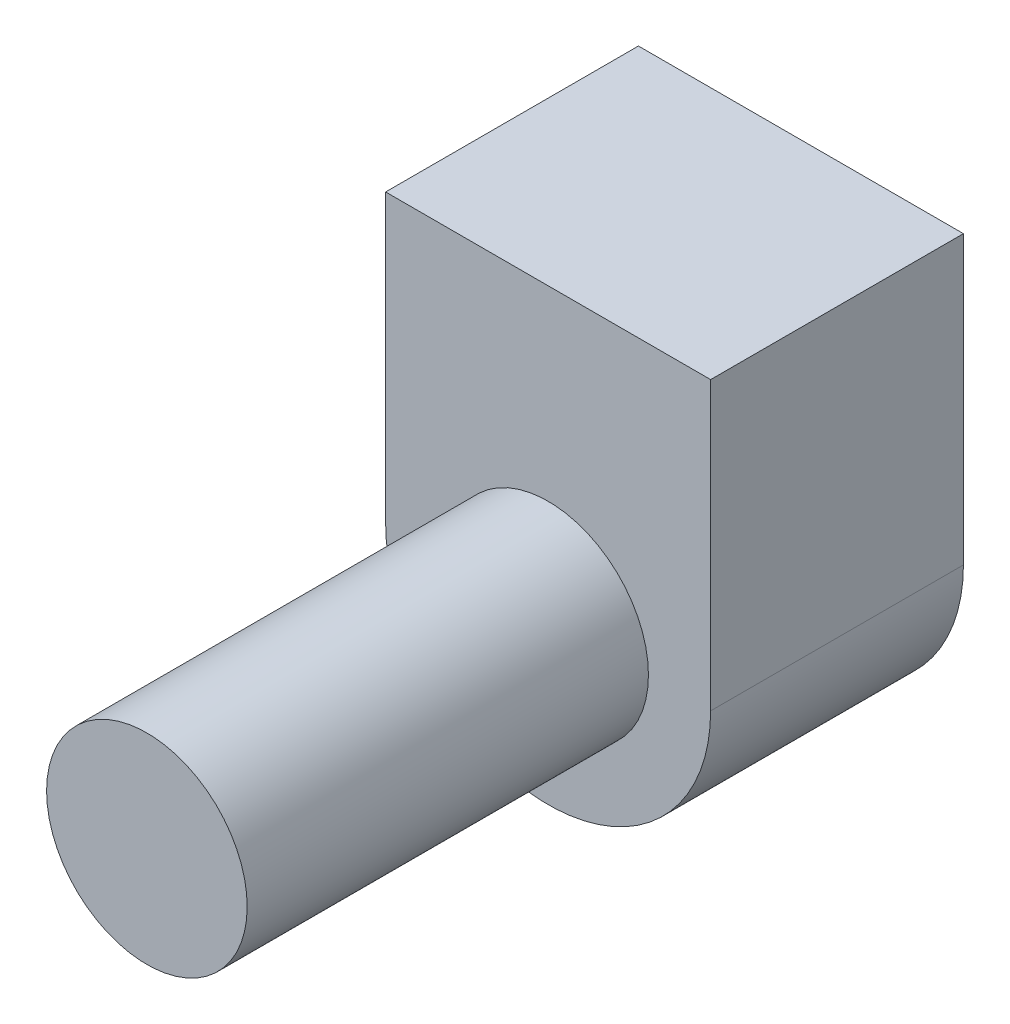
ISO-10303-21;
HEADER;
FILE_DESCRIPTION(('STEP AP214'),'2;1');
FILE_NAME('part.step','',(''),(''),'','','');
FILE_SCHEMA(('AUTOMOTIVE_DESIGN { 1 0 10303 214 1 1 1 1 }'));
ENDSEC;
DATA;
#1=APPLICATION_CONTEXT('core data for automotive mechanical design processes');
#2=APPLICATION_PROTOCOL_DEFINITION('international standard','automotive_design',2000,#1);
#3=PRODUCT_CONTEXT('',#1,'mechanical');
#4=PRODUCT('Part','Part','',(#3));
#5=PRODUCT_RELATED_PRODUCT_CATEGORY('part','',(#4));
#6=PRODUCT_DEFINITION_FORMATION('','',#4);
#7=PRODUCT_DEFINITION_CONTEXT('part definition',#1,'design');
#8=PRODUCT_DEFINITION('design','',#6,#7);
#9=PRODUCT_DEFINITION_SHAPE('','',#8);
#10=(LENGTH_UNIT() NAMED_UNIT(*) SI_UNIT(.MILLI.,.METRE.));
#11=(NAMED_UNIT(*) PLANE_ANGLE_UNIT() SI_UNIT($,.RADIAN.));
#12=(NAMED_UNIT(*) SI_UNIT($,.STERADIAN.) SOLID_ANGLE_UNIT());
#13=UNCERTAINTY_MEASURE_WITH_UNIT(LENGTH_MEASURE(1.E-05),#10,'distance_accuracy_value','');
#14=(GEOMETRIC_REPRESENTATION_CONTEXT(3) GLOBAL_UNCERTAINTY_ASSIGNED_CONTEXT((#13)) GLOBAL_UNIT_ASSIGNED_CONTEXT((#10,
#11,#12)) REPRESENTATION_CONTEXT('',''));
#15=CARTESIAN_POINT('',(0.,0.,0.));
#16=DIRECTION('',(0.,0.,1.));
#17=DIRECTION('',(1.,0.,0.));
#18=AXIS2_PLACEMENT_3D('',#15,#16,#17);
#19=CARTESIAN_POINT('',(10.287,0.,8.001));
#20=DIRECTION('',(-1.,0.,0.));
#21=DIRECTION('',(0.,-1.,0.));
#22=AXIS2_PLACEMENT_3D('',#19,#20,#21);
#23=PLANE('',#22);
#24=DIRECTION('',(0.,1.,0.));
#25=VECTOR('',#24,1.);
#26=CARTESIAN_POINT('',(10.287,0.,-8.001));
#27=LINE('',#26,#25);
#28=CARTESIAN_POINT('',(10.287,-18.161,-8.001));
#29=VERTEX_POINT('',#28);
#30=CARTESIAN_POINT('',(10.287,0.,-8.001));
#31=VERTEX_POINT('',#30);
#32=EDGE_CURVE('E101',#29,#31,#27,.T.);
#33=ORIENTED_EDGE('',*,*,#32,.T.);
#34=DIRECTION('',(0.,0.,-1.));
#35=VECTOR('',#34,1.);
#36=CARTESIAN_POINT('',(10.287,0.,8.001));
#37=LINE('',#36,#35);
#38=CARTESIAN_POINT('',(10.287,0.,8.001));
#39=VERTEX_POINT('',#38);
#40=EDGE_CURVE('E43',#39,#31,#37,.T.);
#41=ORIENTED_EDGE('',*,*,#40,.F.);
#42=DIRECTION('',(0.,1.,0.));
#43=VECTOR('',#42,1.);
#44=CARTESIAN_POINT('',(10.287,0.,8.001));
#45=LINE('',#44,#43);
#46=CARTESIAN_POINT('',(10.287,-18.161,8.001));
#47=VERTEX_POINT('',#46);
#48=EDGE_CURVE('E87',#47,#39,#45,.T.);
#49=ORIENTED_EDGE('',*,*,#48,.F.);
#50=DIRECTION('',(0.,0.,-1.));
#51=VECTOR('',#50,1.);
#52=CARTESIAN_POINT('',(10.287,-18.161,8.001));
#53=LINE('',#52,#51);
#54=EDGE_CURVE('E97',#47,#29,#53,.T.);
#55=ORIENTED_EDGE('',*,*,#54,.T.);
#56=EDGE_LOOP('',(#33,#41,#49,#55));
#57=FACE_BOUND('',#56,.T.);
#58=ADVANCED_FACE('F35',(#57),#23,.F.);
#59=CARTESIAN_POINT('',(-10.287,0.,8.001));
#60=DIRECTION('',(0.,-1.,0.));
#61=DIRECTION('',(1.,0.,0.));
#62=AXIS2_PLACEMENT_3D('',#59,#60,#61);
#63=PLANE('',#62);
#64=DIRECTION('',(-1.,0.,0.));
#65=VECTOR('',#64,1.);
#66=CARTESIAN_POINT('',(-10.287,0.,-8.001));
#67=LINE('',#66,#65);
#68=CARTESIAN_POINT('',(-10.287,0.,-8.001));
#69=VERTEX_POINT('',#68);
#70=EDGE_CURVE('E92',#31,#69,#67,.T.);
#71=ORIENTED_EDGE('',*,*,#70,.T.);
#72=DIRECTION('',(0.,0.,-1.));
#73=VECTOR('',#72,1.);
#74=CARTESIAN_POINT('',(-10.287,0.,8.001));
#75=LINE('',#74,#73);
#76=CARTESIAN_POINT('',(-10.287,0.,8.001));
#77=VERTEX_POINT('',#76);
#78=EDGE_CURVE('E90',#77,#69,#75,.T.);
#79=ORIENTED_EDGE('',*,*,#78,.F.);
#80=DIRECTION('',(-1.,0.,0.));
#81=VECTOR('',#80,1.);
#82=CARTESIAN_POINT('',(-10.287,0.,8.001));
#83=LINE('',#82,#81);
#84=EDGE_CURVE('E82',#39,#77,#83,.T.);
#85=ORIENTED_EDGE('',*,*,#84,.F.);
#86=ORIENTED_EDGE('',*,*,#40,.T.);
#87=EDGE_LOOP('',(#71,#79,#85,#86));
#88=FACE_BOUND('',#87,.T.);
#89=ADVANCED_FACE('F91',(#88),#63,.F.);
#90=CARTESIAN_POINT('',(-10.287,-18.161,8.001));
#91=DIRECTION('',(1.,0.,0.));
#92=DIRECTION('',(0.,1.,0.));
#93=AXIS2_PLACEMENT_3D('',#90,#91,#92);
#94=PLANE('',#93);
#95=DIRECTION('',(0.,-1.,0.));
#96=VECTOR('',#95,1.);
#97=CARTESIAN_POINT('',(-10.287,-18.161,-8.001));
#98=LINE('',#97,#96);
#99=CARTESIAN_POINT('',(-10.287,-18.161,-8.001));
#100=VERTEX_POINT('',#99);
#101=EDGE_CURVE('E68',#69,#100,#98,.T.);
#102=ORIENTED_EDGE('',*,*,#101,.T.);
#103=DIRECTION('',(0.,0.,-1.));
#104=VECTOR('',#103,1.);
#105=CARTESIAN_POINT('',(-10.287,-18.161,8.001));
#106=LINE('',#105,#104);
#107=CARTESIAN_POINT('',(-10.287,-18.161,8.001));
#108=VERTEX_POINT('',#107);
#109=EDGE_CURVE('E93',#108,#100,#106,.T.);
#110=ORIENTED_EDGE('',*,*,#109,.F.);
#111=DIRECTION('',(0.,-1.,0.));
#112=VECTOR('',#111,1.);
#113=CARTESIAN_POINT('',(-10.287,-18.161,8.001));
#114=LINE('',#113,#112);
#115=EDGE_CURVE('E85',#77,#108,#114,.T.);
#116=ORIENTED_EDGE('',*,*,#115,.F.);
#117=ORIENTED_EDGE('',*,*,#78,.T.);
#118=EDGE_LOOP('',(#102,#110,#116,#117));
#119=FACE_BOUND('',#118,.T.);
#120=ADVANCED_FACE('F95',(#119),#94,.F.);
#121=CARTESIAN_POINT('',(0.,-18.161,8.001));
#122=DIRECTION('',(0.,0.,-1.));
#123=DIRECTION('',(-1.,0.,0.));
#124=AXIS2_PLACEMENT_3D('',#121,#122,#123);
#125=CYLINDRICAL_SURFACE('',#124,10.287);
#126=CARTESIAN_POINT('',(0.,-18.161,-8.001));
#127=DIRECTION('',(0.,0.,1.));
#128=DIRECTION('',(-1.,0.,0.));
#129=AXIS2_PLACEMENT_3D('',#126,#127,#128);
#130=CIRCLE('',#129,10.287);
#131=EDGE_CURVE('E74',#100,#29,#130,.T.);
#132=ORIENTED_EDGE('',*,*,#131,.T.);
#133=ORIENTED_EDGE('',*,*,#54,.F.);
#134=CARTESIAN_POINT('',(0.,-18.161,8.001));
#135=DIRECTION('',(0.,0.,1.));
#136=DIRECTION('',(-1.,0.,0.));
#137=AXIS2_PLACEMENT_3D('',#134,#135,#136);
#138=CIRCLE('',#137,10.287);
#139=EDGE_CURVE('E51',#108,#47,#138,.T.);
#140=ORIENTED_EDGE('',*,*,#139,.F.);
#141=ORIENTED_EDGE('',*,*,#109,.T.);
#142=EDGE_LOOP('',(#132,#133,#140,#141));
#143=FACE_BOUND('',#142,.T.);
#144=ADVANCED_FACE('F123',(#143),#125,.T.);
#145=CARTESIAN_POINT('',(0.,-18.161,8.001));
#146=DIRECTION('',(0.,0.,-1.));
#147=DIRECTION('',(-1.,0.,0.));
#148=AXIS2_PLACEMENT_3D('',#145,#146,#147);
#149=PLANE('',#148);
#150=CARTESIAN_POINT('',(0.,-18.161,8.001));
#151=DIRECTION('',(0.,0.,-1.));
#152=DIRECTION('',(-1.,0.,0.));
#153=AXIS2_PLACEMENT_3D('',#150,#151,#152);
#154=CIRCLE('',#153,6.35);
#155=CARTESIAN_POINT('',(-6.35,-18.161,8.001));
#156=VERTEX_POINT('',#155);
#157=EDGE_CURVE('E11',#156,#156,#154,.F.);
#158=ORIENTED_EDGE('',*,*,#157,.F.);
#159=EDGE_LOOP('',(#158));
#160=FACE_BOUND('',#159,.T.);
#161=ORIENTED_EDGE('',*,*,#48,.T.);
#162=ORIENTED_EDGE('',*,*,#84,.T.);
#163=ORIENTED_EDGE('',*,*,#115,.T.);
#164=ORIENTED_EDGE('',*,*,#139,.T.);
#165=EDGE_LOOP('',(#161,#162,#163,#164));
#166=FACE_BOUND('',#165,.T.);
#167=ADVANCED_FACE('F83',(#160,#166),#149,.F.);
#168=CARTESIAN_POINT('',(0.,-18.161,-8.001));
#169=DIRECTION('',(0.,0.,-1.));
#170=DIRECTION('',(-1.,0.,0.));
#171=AXIS2_PLACEMENT_3D('',#168,#169,#170);
#172=PLANE('',#171);
#173=ORIENTED_EDGE('',*,*,#32,.F.);
#174=ORIENTED_EDGE('',*,*,#131,.F.);
#175=ORIENTED_EDGE('',*,*,#101,.F.);
#176=ORIENTED_EDGE('',*,*,#70,.F.);
#177=EDGE_LOOP('',(#173,#174,#175,#176));
#178=FACE_BOUND('',#177,.T.);
#179=ADVANCED_FACE('F112',(#178),#172,.T.);
#180=CARTESIAN_POINT('',(0.,-18.161,33.401));
#181=DIRECTION('',(0.,0.,-1.));
#182=DIRECTION('',(-1.,0.,0.));
#183=AXIS2_PLACEMENT_3D('',#180,#181,#182);
#184=CYLINDRICAL_SURFACE('',#183,6.35);
#185=CARTESIAN_POINT('',(0.,-18.161,33.401));
#186=DIRECTION('',(0.,0.,1.));
#187=DIRECTION('',(1.,0.,0.));
#188=AXIS2_PLACEMENT_3D('',#185,#186,#187);
#189=CIRCLE('',#188,6.35);
#190=CARTESIAN_POINT('',(6.35,-18.161,33.401));
#191=VERTEX_POINT('',#190);
#192=EDGE_CURVE('E104',#191,#191,#189,.T.);
#193=ORIENTED_EDGE('',*,*,#192,.F.);
#194=EDGE_LOOP('',(#193));
#195=FACE_BOUND('',#194,.T.);
#196=ORIENTED_EDGE('',*,*,#157,.T.);
#197=EDGE_LOOP('',(#196));
#198=FACE_BOUND('',#197,.T.);
#199=ADVANCED_FACE('F114',(#195,#198),#184,.T.);
#200=CARTESIAN_POINT('',(0.,-18.161,33.401));
#201=DIRECTION('',(0.,0.,1.));
#202=DIRECTION('',(1.,0.,0.));
#203=AXIS2_PLACEMENT_3D('',#200,#201,#202);
#204=PLANE('',#203);
#205=ORIENTED_EDGE('',*,*,#192,.T.);
#206=EDGE_LOOP('',(#205));
#207=FACE_BOUND('',#206,.T.);
#208=ADVANCED_FACE('F120',(#207),#204,.T.);
#209=CLOSED_SHELL('',(#58,#89,#120,#144,#167,#179,#199,#208));
#210=MANIFOLD_SOLID_BREP('B2',#209);
#211=ADVANCED_BREP_SHAPE_REPRESENTATION('',(#18,#210),#14);
#212=SHAPE_DEFINITION_REPRESENTATION(#9,#211);
ENDSEC;
END-ISO-10303-21;
